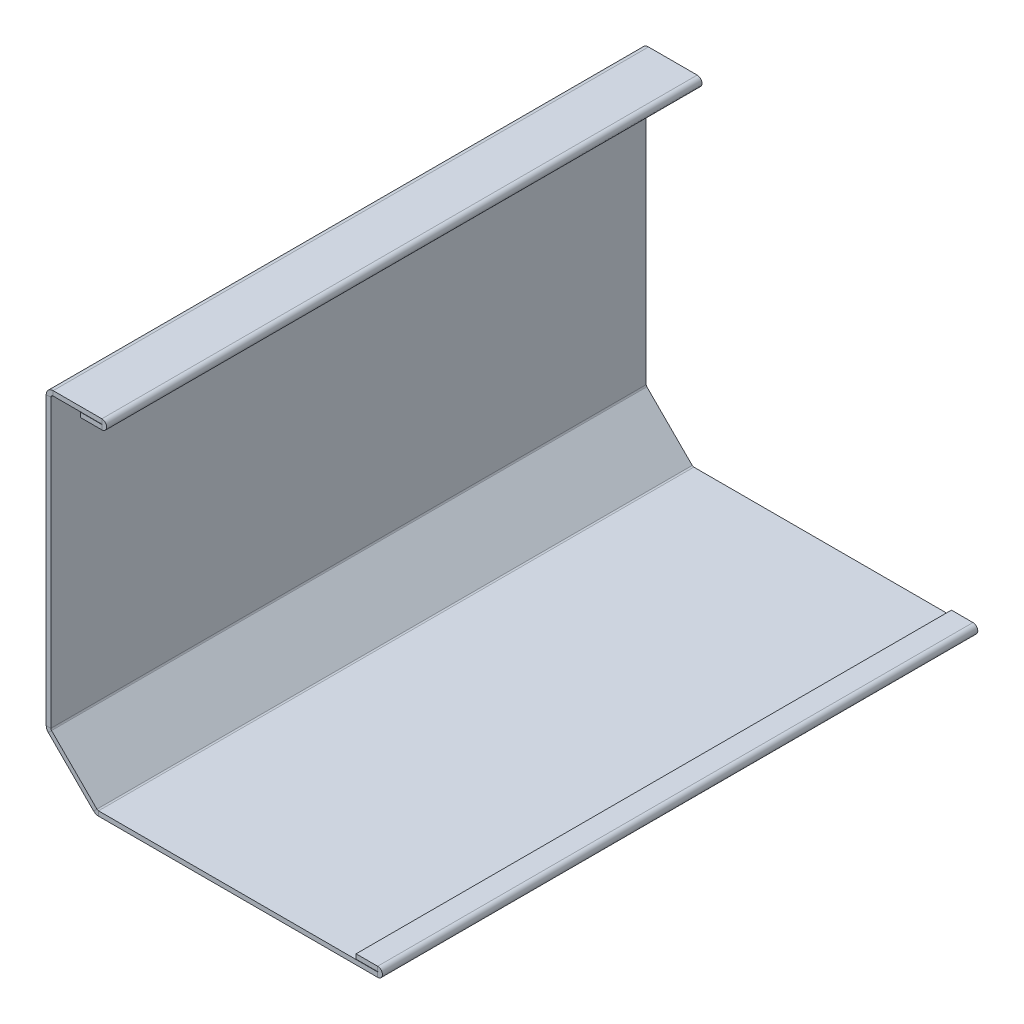
ISO-10303-21;
HEADER;
FILE_DESCRIPTION(('STEP AP214'),'2;1');
FILE_NAME('part.step','',(''),(''),'','','');
FILE_SCHEMA(('AUTOMOTIVE_DESIGN { 1 0 10303 214 1 1 1 1 }'));
ENDSEC;
DATA;
#1=APPLICATION_CONTEXT('core data for automotive mechanical design processes');
#2=APPLICATION_PROTOCOL_DEFINITION('international standard','automotive_design',2000,#1);
#3=PRODUCT_CONTEXT('',#1,'mechanical');
#4=PRODUCT('Part','Part','',(#3));
#5=PRODUCT_RELATED_PRODUCT_CATEGORY('part','',(#4));
#6=PRODUCT_DEFINITION_FORMATION('','',#4);
#7=PRODUCT_DEFINITION_CONTEXT('part definition',#1,'design');
#8=PRODUCT_DEFINITION('design','',#6,#7);
#9=PRODUCT_DEFINITION_SHAPE('','',#8);
#10=(LENGTH_UNIT() NAMED_UNIT(*) SI_UNIT(.MILLI.,.METRE.));
#11=(NAMED_UNIT(*) PLANE_ANGLE_UNIT() SI_UNIT($,.RADIAN.));
#12=(NAMED_UNIT(*) SI_UNIT($,.STERADIAN.) SOLID_ANGLE_UNIT());
#13=UNCERTAINTY_MEASURE_WITH_UNIT(LENGTH_MEASURE(1.E-05),#10,'distance_accuracy_value','');
#14=(GEOMETRIC_REPRESENTATION_CONTEXT(3) GLOBAL_UNCERTAINTY_ASSIGNED_CONTEXT((#13)) GLOBAL_UNIT_ASSIGNED_CONTEXT((#10,
#11,#12)) REPRESENTATION_CONTEXT('',''));
#15=CARTESIAN_POINT('',(0.,0.,0.));
#16=DIRECTION('',(0.,0.,1.));
#17=DIRECTION('',(1.,0.,0.));
#18=AXIS2_PLACEMENT_3D('',#15,#16,#17);
#19=CARTESIAN_POINT('',(-47.,-1.5,-96.));
#20=DIRECTION('',(0.,0.,-1.));
#21=DIRECTION('',(-1.,0.,0.));
#22=AXIS2_PLACEMENT_3D('',#19,#20,#21);
#23=PLANE('',#22);
#24=DIRECTION('',(-1.,0.,0.));
#25=VECTOR('',#24,1.);
#26=CARTESIAN_POINT('',(-47.,0.,-96.));
#27=LINE('',#26,#25);
#28=CARTESIAN_POINT('',(45.45,0.,-96.));
#29=VERTEX_POINT('',#28);
#30=CARTESIAN_POINT('',(-44.5735699463963,0.,-96.));
#31=VERTEX_POINT('',#30);
#32=EDGE_CURVE('E516',#29,#31,#27,.T.);
#33=ORIENTED_EDGE('',*,*,#32,.F.);
#34=DIRECTION('',(0.,-1.,0.));
#35=VECTOR('',#34,1.);
#36=CARTESIAN_POINT('',(45.45,0.,-96.));
#37=LINE('',#36,#35);
#38=CARTESIAN_POINT('',(45.45,-1.5,-96.));
#39=VERTEX_POINT('',#38);
#40=EDGE_CURVE('E115',#29,#39,#37,.T.);
#41=ORIENTED_EDGE('',*,*,#40,.T.);
#42=DIRECTION('',(-1.,0.,0.));
#43=VECTOR('',#42,1.);
#44=CARTESIAN_POINT('',(-47.,-1.5,-96.));
#45=LINE('',#44,#43);
#46=CARTESIAN_POINT('',(-44.5735699463963,-1.5,-96.));
#47=VERTEX_POINT('',#46);
#48=EDGE_CURVE('E107',#39,#47,#45,.T.);
#49=ORIENTED_EDGE('',*,*,#48,.T.);
#50=DIRECTION('',(0.,-1.,0.));
#51=VECTOR('',#50,1.);
#52=CARTESIAN_POINT('',(-44.5735699463963,0.,-96.));
#53=LINE('',#52,#51);
#54=EDGE_CURVE('E513',#31,#47,#53,.T.);
#55=ORIENTED_EDGE('',*,*,#54,.F.);
#56=EDGE_LOOP('',(#33,#41,#49,#55));
#57=FACE_BOUND('',#56,.T.);
#58=ADVANCED_FACE('F99',(#57),#23,.T.);
#59=CARTESIAN_POINT('',(-61.439339827979,110.039339827978,96.));
#60=DIRECTION('',(0.,0.,-1.));
#61=DIRECTION('',(0.,1.,0.));
#62=AXIS2_PLACEMENT_3D('',#59,#60,#61);
#63=PLANE('',#62);
#64=DIRECTION('',(-1.,0.,0.));
#65=VECTOR('',#64,1.);
#66=CARTESIAN_POINT('',(-59.939339827979,107.802739827978,96.));
#67=LINE('',#66,#65);
#68=CARTESIAN_POINT('',(-59.939339827979,107.802739827978,96.));
#69=VERTEX_POINT('',#68);
#70=CARTESIAN_POINT('',(-61.439339827979,107.802739827978,96.));
#71=VERTEX_POINT('',#70);
#72=EDGE_CURVE('E417',#69,#71,#67,.T.);
#73=ORIENTED_EDGE('',*,*,#72,.T.);
#74=DIRECTION('',(0.,1.,0.));
#75=VECTOR('',#74,1.);
#76=CARTESIAN_POINT('',(-61.4393398279778,-1.50000000000068,96.));
#77=LINE('',#76,#75);
#78=CARTESIAN_POINT('',(-61.439339827978,15.3657698815815,96.));
#79=VERTEX_POINT('',#78);
#80=EDGE_CURVE('E437',#79,#71,#77,.T.);
#81=ORIENTED_EDGE('',*,*,#80,.F.);
#82=DIRECTION('',(1.,0.,0.));
#83=VECTOR('',#82,1.);
#84=CARTESIAN_POINT('',(-59.939339827978,15.3657698815815,96.));
#85=LINE('',#84,#83);
#86=CARTESIAN_POINT('',(-59.939339827978,15.3657698815815,96.));
#87=VERTEX_POINT('',#86);
#88=EDGE_CURVE('E447',#87,#79,#85,.F.);
#89=ORIENTED_EDGE('',*,*,#88,.F.);
#90=DIRECTION('',(0.,-1.,0.));
#91=VECTOR('',#90,1.);
#92=CARTESIAN_POINT('',(-59.939339827979,110.039339827978,96.));
#93=LINE('',#92,#91);
#94=EDGE_CURVE('E441',#87,#69,#93,.F.);
#95=ORIENTED_EDGE('',*,*,#94,.T.);
#96=EDGE_LOOP('',(#73,#81,#89,#95));
#97=FACE_BOUND('',#96,.T.);
#98=ADVANCED_FACE('F553',(#97),#63,.F.);
#99=CARTESIAN_POINT('',(-61.439339827978,15.0606601715375,-96.));
#100=DIRECTION('',(0.,0.,1.));
#101=DIRECTION('',(0.,-1.,0.));
#102=AXIS2_PLACEMENT_3D('',#99,#100,#101);
#103=PLANE('',#102);
#104=DIRECTION('',(-1.,0.,0.));
#105=VECTOR('',#104,1.);
#106=CARTESIAN_POINT('',(-59.939339827979,107.802739827978,-95.9999999999999));
#107=LINE('',#106,#105);
#108=CARTESIAN_POINT('',(-59.939339827979,107.802739827978,-95.9999999999999));
#109=VERTEX_POINT('',#108);
#110=CARTESIAN_POINT('',(-61.439339827979,107.802739827978,-95.9999999999999));
#111=VERTEX_POINT('',#110);
#112=EDGE_CURVE('E428',#109,#111,#107,.T.);
#113=ORIENTED_EDGE('',*,*,#112,.F.);
#114=DIRECTION('',(0.,1.,0.));
#115=VECTOR('',#114,1.);
#116=CARTESIAN_POINT('',(-59.939339827978,15.0606601715375,-96.));
#117=LINE('',#116,#115);
#118=CARTESIAN_POINT('',(-59.939339827978,15.3657698815815,-95.9999999999999));
#119=VERTEX_POINT('',#118);
#120=EDGE_CURVE('E439',#109,#119,#117,.F.);
#121=ORIENTED_EDGE('',*,*,#120,.T.);
#122=DIRECTION('',(1.,0.,0.));
#123=VECTOR('',#122,1.);
#124=CARTESIAN_POINT('',(-61.439339827978,15.3657698815815,-96.));
#125=LINE('',#124,#123);
#126=CARTESIAN_POINT('',(-61.439339827978,15.3657698815815,-95.9999999999999));
#127=VERTEX_POINT('',#126);
#128=EDGE_CURVE('E431',#119,#127,#125,.F.);
#129=ORIENTED_EDGE('',*,*,#128,.T.);
#130=DIRECTION('',(0.,-1.,0.));
#131=VECTOR('',#130,1.);
#132=CARTESIAN_POINT('',(-61.4393398279778,-1.50000000000065,-96.));
#133=LINE('',#132,#131);
#134=EDGE_CURVE('E434',#111,#127,#133,.T.);
#135=ORIENTED_EDGE('',*,*,#134,.F.);
#136=EDGE_LOOP('',(#113,#121,#129,#135));
#137=FACE_BOUND('',#136,.T.);
#138=ADVANCED_FACE('F557',(#137),#103,.F.);
#139=CARTESIAN_POINT('',(-61.4393398279778,-1.50000000000067,0.));
#140=DIRECTION('',(1.,0.,0.));
#141=DIRECTION('',(0.,1.,0.));
#142=AXIS2_PLACEMENT_3D('',#139,#140,#141);
#143=PLANE('',#142);
#144=DIRECTION('',(0.,0.,1.));
#145=VECTOR('',#144,1.);
#146=CARTESIAN_POINT('',(-61.439339827979,107.802739827978,96.));
#147=LINE('',#146,#145);
#148=EDGE_CURVE('E411',#71,#111,#147,.F.);
#149=ORIENTED_EDGE('',*,*,#148,.T.);
#150=ORIENTED_EDGE('',*,*,#134,.T.);
#151=DIRECTION('',(0.,0.,1.));
#152=VECTOR('',#151,1.);
#153=CARTESIAN_POINT('',(-61.439339827978,15.3657698815815,-96.));
#154=LINE('',#153,#152);
#155=EDGE_CURVE('E444',#79,#127,#154,.F.);
#156=ORIENTED_EDGE('',*,*,#155,.F.);
#157=ORIENTED_EDGE('',*,*,#80,.T.);
#158=EDGE_LOOP('',(#149,#150,#156,#157));
#159=FACE_BOUND('',#158,.T.);
#160=ADVANCED_FACE('F673',(#159),#143,.F.);
#161=CARTESIAN_POINT('',(-59.9393398279778,-1.50000000000065,0.));
#162=DIRECTION('',(1.,0.,0.));
#163=DIRECTION('',(0.,1.,0.));
#164=AXIS2_PLACEMENT_3D('',#161,#162,#163);
#165=PLANE('',#164);
#166=ORIENTED_EDGE('',*,*,#120,.F.);
#167=DIRECTION('',(0.,0.,1.));
#168=VECTOR('',#167,1.);
#169=CARTESIAN_POINT('',(-59.939339827979,107.802739827978,96.));
#170=LINE('',#169,#168);
#171=EDGE_CURVE('E423',#69,#109,#170,.F.);
#172=ORIENTED_EDGE('',*,*,#171,.F.);
#173=ORIENTED_EDGE('',*,*,#94,.F.);
#174=DIRECTION('',(0.,0.,1.));
#175=VECTOR('',#174,1.);
#176=CARTESIAN_POINT('',(-59.939339827978,15.3657698815815,-96.));
#177=LINE('',#176,#175);
#178=EDGE_CURVE('E450',#119,#87,#177,.T.);
#179=ORIENTED_EDGE('',*,*,#178,.F.);
#180=EDGE_LOOP('',(#166,#172,#173,#179));
#181=FACE_BOUND('',#180,.T.);
#182=ADVANCED_FACE('F589',(#181),#165,.T.);
#183=CARTESIAN_POINT('',(-62.4999999997578,15.4999999997576,96.));
#184=DIRECTION('',(0.,0.,-1.));
#185=DIRECTION('',(0.,1.,0.));
#186=AXIS2_PLACEMENT_3D('',#183,#184,#185);
#187=PLANE('',#186);
#188=DIRECTION('',(-0.707106781186531,-0.707106781186564,0.));
#189=VECTOR('',#188,1.);
#190=CARTESIAN_POINT('',(-59.723594683,14.8449150265595,96.));
#191=LINE('',#190,#189);
#192=CARTESIAN_POINT('',(-59.723594683,14.8449150265595,96.));
#193=VERTEX_POINT('',#192);
#194=CARTESIAN_POINT('',(-60.7842548547798,13.7842548547796,96.));
#195=VERTEX_POINT('',#194);
#196=EDGE_CURVE('E460',#193,#195,#191,.T.);
#197=ORIENTED_EDGE('',*,*,#196,.T.);
#198=DIRECTION('',(-0.707106781186551,0.707106781186544,0.));
#199=VECTOR('',#198,1.);
#200=CARTESIAN_POINT('',(-22.4393398282199,-24.5606601717798,96.));
#201=LINE('',#200,#199);
#202=CARTESIAN_POINT('',(-46.1550849731981,-0.844915026801855,96.));
#203=VERTEX_POINT('',#202);
#204=EDGE_CURVE('E480',#203,#195,#201,.T.);
#205=ORIENTED_EDGE('',*,*,#204,.F.);
#206=DIRECTION('',(0.707106781186544,0.707106781186551,0.));
#207=VECTOR('',#206,1.);
#208=CARTESIAN_POINT('',(-45.0944248014183,0.215745144977974,96.));
#209=LINE('',#208,#207);
#210=CARTESIAN_POINT('',(-45.0944248014183,0.215745144977975,96.));
#211=VERTEX_POINT('',#210);
#212=EDGE_CURVE('E490',#211,#203,#209,.F.);
#213=ORIENTED_EDGE('',*,*,#212,.F.);
#214=DIRECTION('',(0.707106781186551,-0.707106781186544,0.));
#215=VECTOR('',#214,1.);
#216=CARTESIAN_POINT('',(-61.439339827978,16.5606601715375,96.));
#217=LINE('',#216,#215);
#218=EDGE_CURVE('E484',#211,#193,#217,.F.);
#219=ORIENTED_EDGE('',*,*,#218,.T.);
#220=EDGE_LOOP('',(#197,#205,#213,#219));
#221=FACE_BOUND('',#220,.T.);
#222=ADVANCED_FACE('F679',(#221),#187,.F.);
#223=CARTESIAN_POINT('',(-45.9393398282202,-1.06066017177983,-96.));
#224=DIRECTION('',(0.,0.,1.));
#225=DIRECTION('',(0.,-1.,0.));
#226=AXIS2_PLACEMENT_3D('',#223,#224,#225);
#227=PLANE('',#226);
#228=DIRECTION('',(-0.707106781186531,-0.707106781186564,0.));
#229=VECTOR('',#228,1.);
#230=CARTESIAN_POINT('',(-59.723594683,14.8449150265595,-95.9999999999999));
#231=LINE('',#230,#229);
#232=CARTESIAN_POINT('',(-59.723594683,14.8449150265595,-95.9999999999999));
#233=VERTEX_POINT('',#232);
#234=CARTESIAN_POINT('',(-60.7842548547798,13.7842548547796,-95.9999999999999));
#235=VERTEX_POINT('',#234);
#236=EDGE_CURVE('E471',#233,#235,#231,.T.);
#237=ORIENTED_EDGE('',*,*,#236,.F.);
#238=DIRECTION('',(-0.707106781186551,0.707106781186544,0.));
#239=VECTOR('',#238,1.);
#240=CARTESIAN_POINT('',(-44.8786796564404,0.,-96.));
#241=LINE('',#240,#239);
#242=CARTESIAN_POINT('',(-45.0944248014183,0.215745144977975,-96.));
#243=VERTEX_POINT('',#242);
#244=EDGE_CURVE('E482',#233,#243,#241,.F.);
#245=ORIENTED_EDGE('',*,*,#244,.T.);
#246=DIRECTION('',(0.707106781186544,0.707106781186551,0.));
#247=VECTOR('',#246,1.);
#248=CARTESIAN_POINT('',(-46.1550849731982,-0.844915026801838,-96.));
#249=LINE('',#248,#247);
#250=CARTESIAN_POINT('',(-46.1550849731982,-0.844915026801847,-96.));
#251=VERTEX_POINT('',#250);
#252=EDGE_CURVE('E474',#243,#251,#249,.F.);
#253=ORIENTED_EDGE('',*,*,#252,.T.);
#254=DIRECTION('',(0.707106781186551,-0.707106781186544,0.));
#255=VECTOR('',#254,1.);
#256=CARTESIAN_POINT('',(-22.4393398282199,-24.5606601717798,-96.));
#257=LINE('',#256,#255);
#258=EDGE_CURVE('E477',#235,#251,#257,.T.);
#259=ORIENTED_EDGE('',*,*,#258,.F.);
#260=EDGE_LOOP('',(#237,#245,#253,#259));
#261=FACE_BOUND('',#260,.T.);
#262=ADVANCED_FACE('F571',(#261),#227,.F.);
#263=CARTESIAN_POINT('',(-22.4393398282199,-24.5606601717798,0.));
#264=DIRECTION('',(0.707106781186544,0.707106781186551,0.));
#265=DIRECTION('',(-0.707106781186551,0.707106781186544,0.));
#266=AXIS2_PLACEMENT_3D('',#263,#264,#265);
#267=PLANE('',#266);
#268=DIRECTION('',(0.,0.,1.));
#269=VECTOR('',#268,1.);
#270=CARTESIAN_POINT('',(-60.7842548547798,13.7842548547796,96.));
#271=LINE('',#270,#269);
#272=EDGE_CURVE('E454',#195,#235,#271,.F.);
#273=ORIENTED_EDGE('',*,*,#272,.T.);
#274=ORIENTED_EDGE('',*,*,#258,.T.);
#275=DIRECTION('',(0.,0.,1.));
#276=VECTOR('',#275,1.);
#277=CARTESIAN_POINT('',(-46.1550849731982,-0.844915026801844,-96.));
#278=LINE('',#277,#276);
#279=EDGE_CURVE('E487',#203,#251,#278,.F.);
#280=ORIENTED_EDGE('',*,*,#279,.F.);
#281=ORIENTED_EDGE('',*,*,#204,.T.);
#282=EDGE_LOOP('',(#273,#274,#280,#281));
#283=FACE_BOUND('',#282,.T.);
#284=ADVANCED_FACE('F694',(#283),#267,.F.);
#285=CARTESIAN_POINT('',(-21.3786796564401,-23.5,0.));
#286=DIRECTION('',(0.707106781186544,0.707106781186551,0.));
#287=DIRECTION('',(-0.707106781186551,0.707106781186544,0.));
#288=AXIS2_PLACEMENT_3D('',#285,#286,#287);
#289=PLANE('',#288);
#290=ORIENTED_EDGE('',*,*,#244,.F.);
#291=DIRECTION('',(0.,0.,1.));
#292=VECTOR('',#291,1.);
#293=CARTESIAN_POINT('',(-59.723594683,14.8449150265595,96.));
#294=LINE('',#293,#292);
#295=EDGE_CURVE('E466',#193,#233,#294,.F.);
#296=ORIENTED_EDGE('',*,*,#295,.F.);
#297=ORIENTED_EDGE('',*,*,#218,.F.);
#298=DIRECTION('',(0.,0.,1.));
#299=VECTOR('',#298,1.);
#300=CARTESIAN_POINT('',(-45.0944248014183,0.215745144977984,-96.));
#301=LINE('',#300,#299);
#302=EDGE_CURVE('E493',#243,#211,#301,.T.);
#303=ORIENTED_EDGE('',*,*,#302,.F.);
#304=EDGE_LOOP('',(#290,#296,#297,#303));
#305=FACE_BOUND('',#304,.T.);
#306=ADVANCED_FACE('F574',(#305),#289,.T.);
#307=CARTESIAN_POINT('',(-47.,-1.5,96.));
#308=DIRECTION('',(0.,0.,1.));
#309=DIRECTION('',(1.,0.,0.));
#310=AXIS2_PLACEMENT_3D('',#307,#308,#309);
#311=PLANE('',#310);
#312=DIRECTION('',(0.,-1.,0.));
#313=VECTOR('',#312,1.);
#314=CARTESIAN_POINT('',(45.45,0.,96.));
#315=LINE('',#314,#313);
#316=CARTESIAN_POINT('',(45.45,0.,96.));
#317=VERTEX_POINT('',#316);
#318=CARTESIAN_POINT('',(45.45,-1.5,96.));
#319=VERTEX_POINT('',#318);
#320=EDGE_CURVE('E266',#317,#319,#315,.T.);
#321=ORIENTED_EDGE('',*,*,#320,.F.);
#322=DIRECTION('',(1.,0.,0.));
#323=VECTOR('',#322,1.);
#324=CARTESIAN_POINT('',(-47.,0.,96.));
#325=LINE('',#324,#323);
#326=CARTESIAN_POINT('',(-44.5735699463963,0.,96.));
#327=VERTEX_POINT('',#326);
#328=EDGE_CURVE('E102',#327,#317,#325,.T.);
#329=ORIENTED_EDGE('',*,*,#328,.F.);
#330=DIRECTION('',(0.,-1.,0.));
#331=VECTOR('',#330,1.);
#332=CARTESIAN_POINT('',(-44.5735699463963,0.,96.));
#333=LINE('',#332,#331);
#334=CARTESIAN_POINT('',(-44.5735699463963,-1.50000000000001,96.));
#335=VERTEX_POINT('',#334);
#336=EDGE_CURVE('E269',#327,#335,#333,.T.);
#337=ORIENTED_EDGE('',*,*,#336,.T.);
#338=DIRECTION('',(1.,0.,0.));
#339=VECTOR('',#338,1.);
#340=CARTESIAN_POINT('',(-47.,-1.5,96.));
#341=LINE('',#340,#339);
#342=EDGE_CURVE('E13',#335,#319,#341,.T.);
#343=ORIENTED_EDGE('',*,*,#342,.T.);
#344=EDGE_LOOP('',(#321,#329,#337,#343));
#345=FACE_BOUND('',#344,.T.);
#346=ADVANCED_FACE('F263',(#345),#311,.T.);
#347=CARTESIAN_POINT('',(0.,-1.5,0.));
#348=DIRECTION('',(0.,1.,0.));
#349=DIRECTION('',(0.,0.,1.));
#350=AXIS2_PLACEMENT_3D('',#347,#348,#349);
#351=PLANE('',#350);
#352=ORIENTED_EDGE('',*,*,#48,.F.);
#353=DIRECTION('',(0.,0.,-1.));
#354=VECTOR('',#353,1.);
#355=CARTESIAN_POINT('',(45.45,-1.5,-96.));
#356=LINE('',#355,#354);
#357=EDGE_CURVE('E274',#39,#319,#356,.F.);
#358=ORIENTED_EDGE('',*,*,#357,.T.);
#359=ORIENTED_EDGE('',*,*,#342,.F.);
#360=DIRECTION('',(0.,0.,1.));
#361=VECTOR('',#360,1.);
#362=CARTESIAN_POINT('',(-44.5735699463963,-1.50000000000001,96.));
#363=LINE('',#362,#361);
#364=EDGE_CURVE('E497',#335,#47,#363,.F.);
#365=ORIENTED_EDGE('',*,*,#364,.T.);
#366=EDGE_LOOP('',(#352,#358,#359,#365));
#367=FACE_BOUND('',#366,.T.);
#368=ADVANCED_FACE('F275',(#367),#351,.F.);
#369=CARTESIAN_POINT('',(0.,0.,0.));
#370=DIRECTION('',(0.,1.,0.));
#371=DIRECTION('',(0.,0.,1.));
#372=AXIS2_PLACEMENT_3D('',#369,#370,#371);
#373=PLANE('',#372);
#374=DIRECTION('',(0.,0.,-1.));
#375=VECTOR('',#374,1.);
#376=CARTESIAN_POINT('',(45.45,0.,-96.));
#377=LINE('',#376,#375);
#378=EDGE_CURVE('E300',#29,#317,#377,.F.);
#379=ORIENTED_EDGE('',*,*,#378,.F.);
#380=ORIENTED_EDGE('',*,*,#32,.T.);
#381=DIRECTION('',(0.,0.,1.));
#382=VECTOR('',#381,1.);
#383=CARTESIAN_POINT('',(-44.5735699463963,0.,96.));
#384=LINE('',#383,#382);
#385=EDGE_CURVE('E508',#327,#31,#384,.F.);
#386=ORIENTED_EDGE('',*,*,#385,.F.);
#387=ORIENTED_EDGE('',*,*,#328,.T.);
#388=EDGE_LOOP('',(#379,#380,#386,#387));
#389=FACE_BOUND('',#388,.T.);
#390=ADVANCED_FACE('F520',(#389),#373,.T.);
#391=CARTESIAN_POINT('',(-44.5735699463963,0.73659999999999,-96.));
#392=DIRECTION('',(0.,0.,-1.));
#393=DIRECTION('',(-1.,0.,0.));
#394=AXIS2_PLACEMENT_3D('',#391,#392,#393);
#395=PLANE('',#394);
#396=ORIENTED_EDGE('',*,*,#252,.F.);
#397=CARTESIAN_POINT('',(-44.5735699463963,0.73659999999999,-96.));
#398=DIRECTION('',(0.,0.,1.));
#399=DIRECTION('',(1.,0.,0.));
#400=AXIS2_PLACEMENT_3D('',#397,#398,#399);
#401=CIRCLE('',#400,0.736600000000003);
#402=EDGE_CURVE('E505',#31,#243,#401,.F.);
#403=ORIENTED_EDGE('',*,*,#402,.F.);
#404=ORIENTED_EDGE('',*,*,#54,.T.);
#405=CARTESIAN_POINT('',(-44.5735699463963,0.73659999999999,-96.));
#406=DIRECTION('',(0.,0.,1.));
#407=DIRECTION('',(1.,0.,0.));
#408=AXIS2_PLACEMENT_3D('',#405,#406,#407);
#409=CIRCLE('',#408,2.2366);
#410=EDGE_CURVE('E499',#47,#251,#409,.F.);
#411=ORIENTED_EDGE('',*,*,#410,.T.);
#412=EDGE_LOOP('',(#396,#403,#404,#411));
#413=FACE_BOUND('',#412,.T.);
#414=ADVANCED_FACE('F568',(#413),#395,.T.);
#415=CARTESIAN_POINT('',(-44.5735699463963,0.73659999999999,96.));
#416=DIRECTION('',(0.,0.,-1.));
#417=DIRECTION('',(-1.,0.,0.));
#418=AXIS2_PLACEMENT_3D('',#415,#416,#417);
#419=PLANE('',#418);
#420=CARTESIAN_POINT('',(-44.5735699463963,0.73659999999999,96.));
#421=DIRECTION('',(0.,0.,1.));
#422=DIRECTION('',(1.,0.,0.));
#423=AXIS2_PLACEMENT_3D('',#420,#421,#422);
#424=CIRCLE('',#423,0.736600000000003);
#425=EDGE_CURVE('E479',#211,#327,#424,.T.);
#426=ORIENTED_EDGE('',*,*,#425,.F.);
#427=ORIENTED_EDGE('',*,*,#212,.T.);
#428=CARTESIAN_POINT('',(-44.5735699463963,0.73659999999999,96.));
#429=DIRECTION('',(0.,0.,1.));
#430=DIRECTION('',(1.,0.,0.));
#431=AXIS2_PLACEMENT_3D('',#428,#429,#430);
#432=CIRCLE('',#431,2.2366);
#433=EDGE_CURVE('E500',#203,#335,#432,.T.);
#434=ORIENTED_EDGE('',*,*,#433,.T.);
#435=ORIENTED_EDGE('',*,*,#336,.F.);
#436=EDGE_LOOP('',(#426,#427,#434,#435));
#437=FACE_BOUND('',#436,.T.);
#438=ADVANCED_FACE('F708',(#437),#419,.F.);
#439=CARTESIAN_POINT('',(-44.5735699463963,0.73659999999999,96.));
#440=DIRECTION('',(0.,0.,1.));
#441=DIRECTION('',(-0.707106781186544,-0.707106781186551,0.));
#442=AXIS2_PLACEMENT_3D('',#439,#440,#441);
#443=CYLINDRICAL_SURFACE('',#442,2.2366);
#444=ORIENTED_EDGE('',*,*,#364,.F.);
#445=ORIENTED_EDGE('',*,*,#433,.F.);
#446=ORIENTED_EDGE('',*,*,#279,.T.);
#447=ORIENTED_EDGE('',*,*,#410,.F.);
#448=EDGE_LOOP('',(#444,#445,#446,#447));
#449=FACE_BOUND('',#448,.T.);
#450=ADVANCED_FACE('F705',(#449),#443,.T.);
#451=CARTESIAN_POINT('',(-44.5735699463963,0.73659999999999,96.));
#452=DIRECTION('',(0.,0.,1.));
#453=DIRECTION('',(-0.707106781186544,-0.707106781186551,0.));
#454=AXIS2_PLACEMENT_3D('',#451,#452,#453);
#455=CYLINDRICAL_SURFACE('',#454,0.736600000000003);
#456=ORIENTED_EDGE('',*,*,#385,.T.);
#457=ORIENTED_EDGE('',*,*,#402,.T.);
#458=ORIENTED_EDGE('',*,*,#302,.T.);
#459=ORIENTED_EDGE('',*,*,#425,.T.);
#460=EDGE_LOOP('',(#456,#457,#458,#459));
#461=FACE_BOUND('',#460,.T.);
#462=ADVANCED_FACE('F564',(#461),#455,.F.);
#463=CARTESIAN_POINT('',(-59.202739827978,15.3657698815815,-95.9999999999999));
#464=DIRECTION('',(0.,0.,-1.));
#465=DIRECTION('',(-1.,0.,0.));
#466=AXIS2_PLACEMENT_3D('',#463,#464,#465);
#467=PLANE('',#466);
#468=ORIENTED_EDGE('',*,*,#128,.F.);
#469=CARTESIAN_POINT('',(-59.202739827978,15.3657698815815,-95.9999999999999));
#470=DIRECTION('',(0.,0.,1.));
#471=DIRECTION('',(1.,0.,0.));
#472=AXIS2_PLACEMENT_3D('',#469,#470,#471);
#473=CIRCLE('',#472,0.736600000000011);
#474=EDGE_CURVE('E463',#233,#119,#473,.F.);
#475=ORIENTED_EDGE('',*,*,#474,.F.);
#476=ORIENTED_EDGE('',*,*,#236,.T.);
#477=CARTESIAN_POINT('',(-59.202739827978,15.3657698815815,-95.9999999999999));
#478=DIRECTION('',(0.,0.,1.));
#479=DIRECTION('',(1.,0.,0.));
#480=AXIS2_PLACEMENT_3D('',#477,#478,#479);
#481=CIRCLE('',#480,2.23660000000001);
#482=EDGE_CURVE('E456',#235,#127,#481,.F.);
#483=ORIENTED_EDGE('',*,*,#482,.T.);
#484=EDGE_LOOP('',(#468,#475,#476,#483));
#485=FACE_BOUND('',#484,.T.);
#486=ADVANCED_FACE('F583',(#485),#467,.T.);
#487=CARTESIAN_POINT('',(-59.202739827978,15.3657698815815,96.));
#488=DIRECTION('',(0.,0.,-1.));
#489=DIRECTION('',(-1.,0.,0.));
#490=AXIS2_PLACEMENT_3D('',#487,#488,#489);
#491=PLANE('',#490);
#492=CARTESIAN_POINT('',(-59.202739827978,15.3657698815815,96.));
#493=DIRECTION('',(0.,0.,1.));
#494=DIRECTION('',(1.,0.,0.));
#495=AXIS2_PLACEMENT_3D('',#492,#493,#494);
#496=CIRCLE('',#495,0.736600000000011);
#497=EDGE_CURVE('E436',#87,#193,#496,.T.);
#498=ORIENTED_EDGE('',*,*,#497,.F.);
#499=ORIENTED_EDGE('',*,*,#88,.T.);
#500=CARTESIAN_POINT('',(-59.202739827978,15.3657698815815,96.));
#501=DIRECTION('',(0.,0.,1.));
#502=DIRECTION('',(1.,0.,0.));
#503=AXIS2_PLACEMENT_3D('',#500,#501,#502);
#504=CIRCLE('',#503,2.23660000000001);
#505=EDGE_CURVE('E457',#79,#195,#504,.T.);
#506=ORIENTED_EDGE('',*,*,#505,.T.);
#507=ORIENTED_EDGE('',*,*,#196,.F.);
#508=EDGE_LOOP('',(#498,#499,#506,#507));
#509=FACE_BOUND('',#508,.T.);
#510=ADVANCED_FACE('F685',(#509),#491,.F.);
#511=CARTESIAN_POINT('',(-59.202739827978,15.3657698815815,96.));
#512=DIRECTION('',(0.,0.,1.));
#513=DIRECTION('',(-1.,0.,0.));
#514=AXIS2_PLACEMENT_3D('',#511,#512,#513);
#515=CYLINDRICAL_SURFACE('',#514,2.23660000000001);
#516=ORIENTED_EDGE('',*,*,#272,.F.);
#517=ORIENTED_EDGE('',*,*,#505,.F.);
#518=ORIENTED_EDGE('',*,*,#155,.T.);
#519=ORIENTED_EDGE('',*,*,#482,.F.);
#520=EDGE_LOOP('',(#516,#517,#518,#519));
#521=FACE_BOUND('',#520,.T.);
#522=ADVANCED_FACE('F682',(#521),#515,.T.);
#523=CARTESIAN_POINT('',(-59.202739827978,15.3657698815815,96.));
#524=DIRECTION('',(0.,0.,1.));
#525=DIRECTION('',(-1.,0.,0.));
#526=AXIS2_PLACEMENT_3D('',#523,#524,#525);
#527=CYLINDRICAL_SURFACE('',#526,0.736600000000011);
#528=ORIENTED_EDGE('',*,*,#295,.T.);
#529=ORIENTED_EDGE('',*,*,#474,.T.);
#530=ORIENTED_EDGE('',*,*,#178,.T.);
#531=ORIENTED_EDGE('',*,*,#497,.T.);
#532=EDGE_LOOP('',(#528,#529,#530,#531));
#533=FACE_BOUND('',#532,.T.);
#534=ADVANCED_FACE('F578',(#533),#527,.F.);
#535=CARTESIAN_POINT('',(-59.202739827979,107.802739827978,-95.9999999999999));
#536=DIRECTION('',(0.,0.,-1.));
#537=DIRECTION('',(-1.,0.,0.));
#538=AXIS2_PLACEMENT_3D('',#535,#536,#537);
#539=PLANE('',#538);
#540=DIRECTION('',(0.,-1.,0.));
#541=VECTOR('',#540,1.);
#542=CARTESIAN_POINT('',(-59.202739827979,110.039339827978,-96.));
#543=LINE('',#542,#541);
#544=CARTESIAN_POINT('',(-59.202739827979,108.539339827978,-95.9999999999999));
#545=VERTEX_POINT('',#544);
#546=CARTESIAN_POINT('',(-59.202739827979,110.039339827978,-95.9999999999999));
#547=VERTEX_POINT('',#546);
#548=EDGE_CURVE('E390',#545,#547,#543,.F.);
#549=ORIENTED_EDGE('',*,*,#548,.F.);
#550=CARTESIAN_POINT('',(-59.202739827979,107.802739827978,-95.9999999999999));
#551=DIRECTION('',(0.,0.,1.));
#552=DIRECTION('',(1.,0.,0.));
#553=AXIS2_PLACEMENT_3D('',#550,#551,#552);
#554=CIRCLE('',#553,0.73659999999999);
#555=EDGE_CURVE('E420',#109,#545,#554,.F.);
#556=ORIENTED_EDGE('',*,*,#555,.F.);
#557=ORIENTED_EDGE('',*,*,#112,.T.);
#558=CARTESIAN_POINT('',(-59.202739827979,107.802739827978,-95.9999999999999));
#559=DIRECTION('',(0.,0.,1.));
#560=DIRECTION('',(1.,0.,0.));
#561=AXIS2_PLACEMENT_3D('',#558,#559,#560);
#562=CIRCLE('',#561,2.23659999999999);
#563=EDGE_CURVE('E413',#111,#547,#562,.F.);
#564=ORIENTED_EDGE('',*,*,#563,.T.);
#565=EDGE_LOOP('',(#549,#556,#557,#564));
#566=FACE_BOUND('',#565,.T.);
#567=ADVANCED_FACE('F598',(#566),#539,.T.);
#568=CARTESIAN_POINT('',(-59.202739827979,107.802739827978,96.));
#569=DIRECTION('',(0.,0.,-1.));
#570=DIRECTION('',(-1.,0.,0.));
#571=AXIS2_PLACEMENT_3D('',#568,#569,#570);
#572=PLANE('',#571);
#573=CARTESIAN_POINT('',(-59.202739827979,107.802739827978,96.));
#574=DIRECTION('',(0.,0.,1.));
#575=DIRECTION('',(1.,0.,0.));
#576=AXIS2_PLACEMENT_3D('',#573,#574,#575);
#577=CIRCLE('',#576,0.73659999999999);
#578=CARTESIAN_POINT('',(-59.202739827979,108.539339827978,96.));
#579=VERTEX_POINT('',#578);
#580=EDGE_CURVE('E394',#579,#69,#577,.T.);
#581=ORIENTED_EDGE('',*,*,#580,.F.);
#582=DIRECTION('',(0.,-1.,0.));
#583=VECTOR('',#582,1.);
#584=CARTESIAN_POINT('',(-59.202739827979,108.539339827978,96.));
#585=LINE('',#584,#583);
#586=CARTESIAN_POINT('',(-59.202739827979,110.039339827978,96.));
#587=VERTEX_POINT('',#586);
#588=EDGE_CURVE('E404',#579,#587,#585,.F.);
#589=ORIENTED_EDGE('',*,*,#588,.T.);
#590=CARTESIAN_POINT('',(-59.202739827979,107.802739827978,96.));
#591=DIRECTION('',(0.,0.,1.));
#592=DIRECTION('',(1.,0.,0.));
#593=AXIS2_PLACEMENT_3D('',#590,#591,#592);
#594=CIRCLE('',#593,2.23659999999999);
#595=EDGE_CURVE('E414',#587,#71,#594,.T.);
#596=ORIENTED_EDGE('',*,*,#595,.T.);
#597=ORIENTED_EDGE('',*,*,#72,.F.);
#598=EDGE_LOOP('',(#581,#589,#596,#597));
#599=FACE_BOUND('',#598,.T.);
#600=ADVANCED_FACE('F609',(#599),#572,.F.);
#601=CARTESIAN_POINT('',(-59.202739827979,107.802739827978,96.));
#602=DIRECTION('',(0.,0.,1.));
#603=DIRECTION('',(0.,1.,0.));
#604=AXIS2_PLACEMENT_3D('',#601,#602,#603);
#605=CYLINDRICAL_SURFACE('',#604,2.23659999999999);
#606=ORIENTED_EDGE('',*,*,#148,.F.);
#607=ORIENTED_EDGE('',*,*,#595,.F.);
#608=DIRECTION('',(0.,0.,1.));
#609=VECTOR('',#608,1.);
#610=CARTESIAN_POINT('',(-59.202739827979,110.039339827978,-96.));
#611=LINE('',#610,#609);
#612=EDGE_CURVE('E401',#587,#547,#611,.F.);
#613=ORIENTED_EDGE('',*,*,#612,.T.);
#614=ORIENTED_EDGE('',*,*,#563,.F.);
#615=EDGE_LOOP('',(#606,#607,#613,#614));
#616=FACE_BOUND('',#615,.T.);
#617=ADVANCED_FACE('F663',(#616),#605,.T.);
#618=CARTESIAN_POINT('',(-59.202739827979,107.802739827978,96.));
#619=DIRECTION('',(0.,0.,1.));
#620=DIRECTION('',(0.,1.,0.));
#621=AXIS2_PLACEMENT_3D('',#618,#619,#620);
#622=CYLINDRICAL_SURFACE('',#621,0.73659999999999);
#623=ORIENTED_EDGE('',*,*,#171,.T.);
#624=ORIENTED_EDGE('',*,*,#555,.T.);
#625=DIRECTION('',(0.,0.,1.));
#626=VECTOR('',#625,1.);
#627=CARTESIAN_POINT('',(-59.202739827979,108.539339827978,-96.));
#628=LINE('',#627,#626);
#629=EDGE_CURVE('E407',#545,#579,#628,.T.);
#630=ORIENTED_EDGE('',*,*,#629,.T.);
#631=ORIENTED_EDGE('',*,*,#580,.T.);
#632=EDGE_LOOP('',(#623,#624,#630,#631));
#633=FACE_BOUND('',#632,.T.);
#634=ADVANCED_FACE('F593',(#633),#622,.F.);
#635=CARTESIAN_POINT('',(-41.939339827979,110.039339827978,96.));
#636=DIRECTION('',(0.,0.,-1.));
#637=DIRECTION('',(0.,1.,0.));
#638=AXIS2_PLACEMENT_3D('',#635,#636,#637);
#639=PLANE('',#638);
#640=DIRECTION('',(-1.,0.,0.));
#641=VECTOR('',#640,1.);
#642=CARTESIAN_POINT('',(-41.939339827979,108.539339827978,96.));
#643=LINE('',#642,#641);
#644=CARTESIAN_POINT('',(-43.489339827979,108.539339827978,96.));
#645=VERTEX_POINT('',#644);
#646=EDGE_CURVE('E399',#579,#645,#643,.F.);
#647=ORIENTED_EDGE('',*,*,#646,.T.);
#648=DIRECTION('',(1.3877787807816E-13,1.,0.));
#649=VECTOR('',#648,1.);
#650=CARTESIAN_POINT('',(-43.489339827979,108.539339827978,96.));
#651=LINE('',#650,#649);
#652=CARTESIAN_POINT('',(-43.489339827979,110.039339827978,96.));
#653=VERTEX_POINT('',#652);
#654=EDGE_CURVE('E123',#645,#653,#651,.T.);
#655=ORIENTED_EDGE('',*,*,#654,.T.);
#656=DIRECTION('',(1.,0.,0.));
#657=VECTOR('',#656,1.);
#658=CARTESIAN_POINT('',(-1.53233983065294E-12,110.039339827979,96.));
#659=LINE('',#658,#657);
#660=EDGE_CURVE('E395',#587,#653,#659,.T.);
#661=ORIENTED_EDGE('',*,*,#660,.F.);
#662=ORIENTED_EDGE('',*,*,#588,.F.);
#663=EDGE_LOOP('',(#647,#655,#661,#662));
#664=FACE_BOUND('',#663,.T.);
#665=ADVANCED_FACE('F611',(#664),#639,.F.);
#666=CARTESIAN_POINT('',(-59.939339827979,110.039339827978,-96.));
#667=DIRECTION('',(0.,0.,1.));
#668=DIRECTION('',(0.,-1.,0.));
#669=AXIS2_PLACEMENT_3D('',#666,#667,#668);
#670=PLANE('',#669);
#671=DIRECTION('',(-1.,0.,0.));
#672=VECTOR('',#671,1.);
#673=CARTESIAN_POINT('',(-1.53233983065294E-12,110.039339827979,-96.));
#674=LINE('',#673,#672);
#675=CARTESIAN_POINT('',(-43.4893398279788,110.039339827978,-96.));
#676=VERTEX_POINT('',#675);
#677=EDGE_CURVE('E392',#676,#547,#674,.T.);
#678=ORIENTED_EDGE('',*,*,#677,.F.);
#679=DIRECTION('',(1.3877787807816E-13,1.,0.));
#680=VECTOR('',#679,1.);
#681=CARTESIAN_POINT('',(-43.489339827979,108.539339827978,-96.));
#682=LINE('',#681,#680);
#683=CARTESIAN_POINT('',(-43.489339827979,108.539339827978,-96.));
#684=VERTEX_POINT('',#683);
#685=EDGE_CURVE('E354',#684,#676,#682,.T.);
#686=ORIENTED_EDGE('',*,*,#685,.F.);
#687=DIRECTION('',(1.,0.,0.));
#688=VECTOR('',#687,1.);
#689=CARTESIAN_POINT('',(-59.939339827979,108.539339827978,-96.));
#690=LINE('',#689,#688);
#691=EDGE_CURVE('E397',#684,#545,#690,.F.);
#692=ORIENTED_EDGE('',*,*,#691,.T.);
#693=ORIENTED_EDGE('',*,*,#548,.T.);
#694=EDGE_LOOP('',(#678,#686,#692,#693));
#695=FACE_BOUND('',#694,.T.);
#696=ADVANCED_FACE('F601',(#695),#670,.F.);
#697=CARTESIAN_POINT('',(-1.53233983065294E-12,110.039339827979,0.));
#698=DIRECTION('',(0.,-1.,0.));
#699=DIRECTION('',(1.,0.,0.));
#700=AXIS2_PLACEMENT_3D('',#697,#698,#699);
#701=PLANE('',#700);
#702=ORIENTED_EDGE('',*,*,#660,.T.);
#703=DIRECTION('',(0.,0.,1.));
#704=VECTOR('',#703,1.);
#705=CARTESIAN_POINT('',(-43.4893398279788,110.039339827978,96.));
#706=LINE('',#705,#704);
#707=EDGE_CURVE('E337',#653,#676,#706,.F.);
#708=ORIENTED_EDGE('',*,*,#707,.T.);
#709=ORIENTED_EDGE('',*,*,#677,.T.);
#710=ORIENTED_EDGE('',*,*,#612,.F.);
#711=EDGE_LOOP('',(#702,#708,#709,#710));
#712=FACE_BOUND('',#711,.T.);
#713=ADVANCED_FACE('F614',(#712),#701,.F.);
#714=CARTESIAN_POINT('',(-1.5112126275504E-12,108.539339827979,0.));
#715=DIRECTION('',(0.,-1.,0.));
#716=DIRECTION('',(1.,0.,0.));
#717=AXIS2_PLACEMENT_3D('',#714,#715,#716);
#718=PLANE('',#717);
#719=DIRECTION('',(0.,0.,1.));
#720=VECTOR('',#719,1.);
#721=CARTESIAN_POINT('',(-43.489339827979,108.539339827978,96.));
#722=LINE('',#721,#720);
#723=EDGE_CURVE('E349',#645,#684,#722,.F.);
#724=ORIENTED_EDGE('',*,*,#723,.F.);
#725=ORIENTED_EDGE('',*,*,#646,.F.);
#726=ORIENTED_EDGE('',*,*,#629,.F.);
#727=ORIENTED_EDGE('',*,*,#691,.F.);
#728=EDGE_LOOP('',(#724,#725,#726,#727));
#729=FACE_BOUND('',#728,.T.);
#730=ADVANCED_FACE('F604',(#729),#718,.T.);
#731=CARTESIAN_POINT('',(-46.9643398279789,106.939339827978,96.));
#732=DIRECTION('',(0.,0.,-1.));
#733=DIRECTION('',(1.,0.,0.));
#734=AXIS2_PLACEMENT_3D('',#731,#732,#733);
#735=PLANE('',#734);
#736=DIRECTION('',(0.,-1.,0.));
#737=VECTOR('',#736,1.);
#738=CARTESIAN_POINT('',(-43.4893398279789,106.939339827978,96.));
#739=LINE('',#738,#737);
#740=CARTESIAN_POINT('',(-43.489339827979,108.439339827978,96.));
#741=VERTEX_POINT('',#740);
#742=CARTESIAN_POINT('',(-43.4893398279789,106.939339827978,96.));
#743=VERTEX_POINT('',#742);
#744=EDGE_CURVE('E384',#741,#743,#739,.T.);
#745=ORIENTED_EDGE('',*,*,#744,.F.);
#746=DIRECTION('',(1.,0.,0.));
#747=VECTOR('',#746,1.);
#748=CARTESIAN_POINT('',(-46.964339827979,108.439339827978,96.));
#749=LINE('',#748,#747);
#750=CARTESIAN_POINT('',(-50.439339827979,108.439339827978,96.));
#751=VERTEX_POINT('',#750);
#752=EDGE_CURVE('E375',#751,#741,#749,.T.);
#753=ORIENTED_EDGE('',*,*,#752,.F.);
#754=DIRECTION('',(0.,-1.,0.));
#755=VECTOR('',#754,1.);
#756=CARTESIAN_POINT('',(-50.4393398279789,106.939339827978,96.));
#757=LINE('',#756,#755);
#758=CARTESIAN_POINT('',(-50.4393398279789,106.939339827978,96.));
#759=VERTEX_POINT('',#758);
#760=EDGE_CURVE('E382',#751,#759,#757,.T.);
#761=ORIENTED_EDGE('',*,*,#760,.T.);
#762=DIRECTION('',(1.,0.,0.));
#763=VECTOR('',#762,1.);
#764=CARTESIAN_POINT('',(-46.9643398279789,106.939339827978,96.));
#765=LINE('',#764,#763);
#766=EDGE_CURVE('E363',#759,#743,#765,.T.);
#767=ORIENTED_EDGE('',*,*,#766,.T.);
#768=EDGE_LOOP('',(#745,#753,#761,#767));
#769=FACE_BOUND('',#768,.T.);
#770=ADVANCED_FACE('F624',(#769),#735,.F.);
#771=CARTESIAN_POINT('',(-50.4393398279789,106.939339827978,0.));
#772=DIRECTION('',(1.,0.,0.));
#773=DIRECTION('',(0.,0.,1.));
#774=AXIS2_PLACEMENT_3D('',#771,#772,#773);
#775=PLANE('',#774);
#776=ORIENTED_EDGE('',*,*,#760,.F.);
#777=DIRECTION('',(0.,0.,1.));
#778=VECTOR('',#777,1.);
#779=CARTESIAN_POINT('',(-50.439339827979,108.439339827978,0.));
#780=LINE('',#779,#778);
#781=CARTESIAN_POINT('',(-50.439339827979,108.439339827978,-96.));
#782=VERTEX_POINT('',#781);
#783=EDGE_CURVE('E372',#782,#751,#780,.T.);
#784=ORIENTED_EDGE('',*,*,#783,.F.);
#785=DIRECTION('',(0.,-1.,0.));
#786=VECTOR('',#785,1.);
#787=CARTESIAN_POINT('',(-50.439339827979,106.939339827978,-96.));
#788=LINE('',#787,#786);
#789=CARTESIAN_POINT('',(-50.439339827979,106.939339827978,-96.));
#790=VERTEX_POINT('',#789);
#791=EDGE_CURVE('E362',#782,#790,#788,.T.);
#792=ORIENTED_EDGE('',*,*,#791,.T.);
#793=DIRECTION('',(0.,0.,1.));
#794=VECTOR('',#793,1.);
#795=CARTESIAN_POINT('',(-50.4393398279789,106.939339827978,0.));
#796=LINE('',#795,#794);
#797=EDGE_CURVE('E359',#790,#759,#796,.T.);
#798=ORIENTED_EDGE('',*,*,#797,.T.);
#799=EDGE_LOOP('',(#776,#784,#792,#798));
#800=FACE_BOUND('',#799,.T.);
#801=ADVANCED_FACE('F643',(#800),#775,.F.);
#802=CARTESIAN_POINT('',(-46.964339827979,106.939339827978,-96.));
#803=DIRECTION('',(0.,0.,1.));
#804=DIRECTION('',(-1.,0.,0.));
#805=AXIS2_PLACEMENT_3D('',#802,#803,#804);
#806=PLANE('',#805);
#807=DIRECTION('',(1.,0.,0.));
#808=VECTOR('',#807,1.);
#809=CARTESIAN_POINT('',(-46.964339827979,108.439339827978,-96.));
#810=LINE('',#809,#808);
#811=CARTESIAN_POINT('',(-43.489339827979,108.439339827978,-96.));
#812=VERTEX_POINT('',#811);
#813=EDGE_CURVE('E357',#812,#782,#810,.F.);
#814=ORIENTED_EDGE('',*,*,#813,.F.);
#815=DIRECTION('',(0.,-1.,0.));
#816=VECTOR('',#815,1.);
#817=CARTESIAN_POINT('',(-43.489339827979,106.939339827978,-96.));
#818=LINE('',#817,#816);
#819=CARTESIAN_POINT('',(-43.489339827979,106.939339827978,-96.));
#820=VERTEX_POINT('',#819);
#821=EDGE_CURVE('E387',#812,#820,#818,.T.);
#822=ORIENTED_EDGE('',*,*,#821,.T.);
#823=DIRECTION('',(-1.,0.,0.));
#824=VECTOR('',#823,1.);
#825=CARTESIAN_POINT('',(-46.964339827979,106.939339827978,-96.));
#826=LINE('',#825,#824);
#827=EDGE_CURVE('E369',#820,#790,#826,.T.);
#828=ORIENTED_EDGE('',*,*,#827,.T.);
#829=ORIENTED_EDGE('',*,*,#791,.F.);
#830=EDGE_LOOP('',(#814,#822,#828,#829));
#831=FACE_BOUND('',#830,.T.);
#832=ADVANCED_FACE('F638',(#831),#806,.F.);
#833=CARTESIAN_POINT('',(-46.9643398279789,106.939339827978,0.));
#834=DIRECTION('',(0.,-1.,0.));
#835=DIRECTION('',(1.,0.,0.));
#836=AXIS2_PLACEMENT_3D('',#833,#834,#835);
#837=PLANE('',#836);
#838=ORIENTED_EDGE('',*,*,#797,.F.);
#839=ORIENTED_EDGE('',*,*,#827,.F.);
#840=DIRECTION('',(0.,0.,-1.));
#841=VECTOR('',#840,1.);
#842=CARTESIAN_POINT('',(-43.489339827979,106.939339827978,0.));
#843=LINE('',#842,#841);
#844=EDGE_CURVE('E366',#743,#820,#843,.T.);
#845=ORIENTED_EDGE('',*,*,#844,.F.);
#846=ORIENTED_EDGE('',*,*,#766,.F.);
#847=EDGE_LOOP('',(#838,#839,#845,#846));
#848=FACE_BOUND('',#847,.T.);
#849=ADVANCED_FACE('F641',(#848),#837,.T.);
#850=CARTESIAN_POINT('',(-46.964339827979,108.439339827978,0.));
#851=DIRECTION('',(0.,-1.,0.));
#852=DIRECTION('',(1.,0.,0.));
#853=AXIS2_PLACEMENT_3D('',#850,#851,#852);
#854=PLANE('',#853);
#855=ORIENTED_EDGE('',*,*,#783,.T.);
#856=ORIENTED_EDGE('',*,*,#752,.T.);
#857=DIRECTION('',(0.,0.,1.));
#858=VECTOR('',#857,1.);
#859=CARTESIAN_POINT('',(-43.489339827979,108.439339827978,0.));
#860=LINE('',#859,#858);
#861=EDGE_CURVE('E378',#741,#812,#860,.F.);
#862=ORIENTED_EDGE('',*,*,#861,.T.);
#863=ORIENTED_EDGE('',*,*,#813,.T.);
#864=EDGE_LOOP('',(#855,#856,#862,#863));
#865=FACE_BOUND('',#864,.T.);
#866=ADVANCED_FACE('F628',(#865),#854,.F.);
#867=CARTESIAN_POINT('',(-43.489339827979,108.489339827978,-96.));
#868=DIRECTION('',(0.,0.,-1.));
#869=DIRECTION('',(0.,1.,0.));
#870=AXIS2_PLACEMENT_3D('',#867,#868,#869);
#871=PLANE('',#870);
#872=ORIENTED_EDGE('',*,*,#821,.F.);
#873=CARTESIAN_POINT('',(-43.489339827979,108.489339827978,-96.));
#874=DIRECTION('',(0.,0.,1.));
#875=DIRECTION('',(0.,-1.,0.));
#876=AXIS2_PLACEMENT_3D('',#873,#874,#875);
#877=CIRCLE('',#876,0.0499999999999945);
#878=EDGE_CURVE('E346',#684,#812,#877,.F.);
#879=ORIENTED_EDGE('',*,*,#878,.F.);
#880=ORIENTED_EDGE('',*,*,#685,.T.);
#881=CARTESIAN_POINT('',(-43.489339827979,108.489339827978,-96.));
#882=DIRECTION('',(0.,0.,1.));
#883=DIRECTION('',(0.,-1.,0.));
#884=AXIS2_PLACEMENT_3D('',#881,#882,#883);
#885=CIRCLE('',#884,1.54999999999999);
#886=EDGE_CURVE('E340',#676,#820,#885,.F.);
#887=ORIENTED_EDGE('',*,*,#886,.T.);
#888=EDGE_LOOP('',(#872,#879,#880,#887));
#889=FACE_BOUND('',#888,.T.);
#890=ADVANCED_FACE('F636',(#889),#871,.T.);
#891=CARTESIAN_POINT('',(-43.489339827979,108.489339827978,96.));
#892=DIRECTION('',(0.,0.,-1.));
#893=DIRECTION('',(0.,1.,0.));
#894=AXIS2_PLACEMENT_3D('',#891,#892,#893);
#895=PLANE('',#894);
#896=CARTESIAN_POINT('',(-43.489339827979,108.489339827978,96.));
#897=DIRECTION('',(0.,0.,1.));
#898=DIRECTION('',(0.,-1.,0.));
#899=AXIS2_PLACEMENT_3D('',#896,#897,#898);
#900=CIRCLE('',#899,0.0499999999999945);
#901=EDGE_CURVE('E335',#741,#645,#900,.T.);
#902=ORIENTED_EDGE('',*,*,#901,.F.);
#903=ORIENTED_EDGE('',*,*,#744,.T.);
#904=CARTESIAN_POINT('',(-43.489339827979,108.489339827978,96.));
#905=DIRECTION('',(0.,0.,1.));
#906=DIRECTION('',(0.,-1.,0.));
#907=AXIS2_PLACEMENT_3D('',#904,#905,#906);
#908=CIRCLE('',#907,1.54999999999999);
#909=EDGE_CURVE('E341',#743,#653,#908,.T.);
#910=ORIENTED_EDGE('',*,*,#909,.T.);
#911=ORIENTED_EDGE('',*,*,#654,.F.);
#912=EDGE_LOOP('',(#902,#903,#910,#911));
#913=FACE_BOUND('',#912,.T.);
#914=ADVANCED_FACE('F621',(#913),#895,.F.);
#915=CARTESIAN_POINT('',(-43.489339827979,108.489339827978,96.));
#916=DIRECTION('',(0.,0.,1.));
#917=DIRECTION('',(0.,-1.,0.));
#918=AXIS2_PLACEMENT_3D('',#915,#916,#917);
#919=CYLINDRICAL_SURFACE('',#918,1.54999999999999);
#920=ORIENTED_EDGE('',*,*,#707,.F.);
#921=ORIENTED_EDGE('',*,*,#909,.F.);
#922=ORIENTED_EDGE('',*,*,#844,.T.);
#923=ORIENTED_EDGE('',*,*,#886,.F.);
#924=EDGE_LOOP('',(#920,#921,#922,#923));
#925=FACE_BOUND('',#924,.T.);
#926=ADVANCED_FACE('F618',(#925),#919,.T.);
#927=CARTESIAN_POINT('',(-43.489339827979,108.489339827978,96.));
#928=DIRECTION('',(0.,0.,1.));
#929=DIRECTION('',(0.,-1.,0.));
#930=AXIS2_PLACEMENT_3D('',#927,#928,#929);
#931=CYLINDRICAL_SURFACE('',#930,0.0499999999999945);
#932=ORIENTED_EDGE('',*,*,#723,.T.);
#933=ORIENTED_EDGE('',*,*,#878,.T.);
#934=ORIENTED_EDGE('',*,*,#861,.F.);
#935=ORIENTED_EDGE('',*,*,#901,.T.);
#936=EDGE_LOOP('',(#932,#933,#934,#935));
#937=FACE_BOUND('',#936,.T.);
#938=ADVANCED_FACE('F632',(#937),#931,.F.);
#939=CARTESIAN_POINT('',(41.975,1.6,-96.));
#940=DIRECTION('',(0.,0.,1.));
#941=DIRECTION('',(1.,0.,0.));
#942=AXIS2_PLACEMENT_3D('',#939,#940,#941);
#943=PLANE('',#942);
#944=DIRECTION('',(0.,1.,0.));
#945=VECTOR('',#944,1.);
#946=CARTESIAN_POINT('',(45.45,1.6,-96.));
#947=LINE('',#946,#945);
#948=CARTESIAN_POINT('',(45.45,0.1,-96.));
#949=VERTEX_POINT('',#948);
#950=CARTESIAN_POINT('',(45.45,1.6,-96.));
#951=VERTEX_POINT('',#950);
#952=EDGE_CURVE('E329',#949,#951,#947,.T.);
#953=ORIENTED_EDGE('',*,*,#952,.F.);
#954=DIRECTION('',(1.,0.,0.));
#955=VECTOR('',#954,1.);
#956=CARTESIAN_POINT('',(41.975,0.1,-96.));
#957=LINE('',#956,#955);
#958=CARTESIAN_POINT('',(38.5,0.1,-96.));
#959=VERTEX_POINT('',#958);
#960=EDGE_CURVE('E320',#959,#949,#957,.T.);
#961=ORIENTED_EDGE('',*,*,#960,.F.);
#962=DIRECTION('',(0.,1.,0.));
#963=VECTOR('',#962,1.);
#964=CARTESIAN_POINT('',(38.5,1.6,-96.));
#965=LINE('',#964,#963);
#966=CARTESIAN_POINT('',(38.5,1.6,-96.));
#967=VERTEX_POINT('',#966);
#968=EDGE_CURVE('E327',#959,#967,#965,.T.);
#969=ORIENTED_EDGE('',*,*,#968,.T.);
#970=DIRECTION('',(1.,0.,0.));
#971=VECTOR('',#970,1.);
#972=CARTESIAN_POINT('',(41.975,1.6,-96.));
#973=LINE('',#972,#971);
#974=EDGE_CURVE('E310',#967,#951,#973,.T.);
#975=ORIENTED_EDGE('',*,*,#974,.T.);
#976=EDGE_LOOP('',(#953,#961,#969,#975));
#977=FACE_BOUND('',#976,.T.);
#978=ADVANCED_FACE('F529',(#977),#943,.F.);
#979=CARTESIAN_POINT('',(38.5,1.6,0.));
#980=DIRECTION('',(1.,0.,0.));
#981=DIRECTION('',(0.,0.,-1.));
#982=AXIS2_PLACEMENT_3D('',#979,#980,#981);
#983=PLANE('',#982);
#984=ORIENTED_EDGE('',*,*,#968,.F.);
#985=DIRECTION('',(0.,0.,1.));
#986=VECTOR('',#985,1.);
#987=CARTESIAN_POINT('',(38.5,0.1,0.));
#988=LINE('',#987,#986);
#989=CARTESIAN_POINT('',(38.5,0.1,96.));
#990=VERTEX_POINT('',#989);
#991=EDGE_CURVE('E317',#990,#959,#988,.F.);
#992=ORIENTED_EDGE('',*,*,#991,.F.);
#993=DIRECTION('',(0.,1.,0.));
#994=VECTOR('',#993,1.);
#995=CARTESIAN_POINT('',(38.5,1.6,96.));
#996=LINE('',#995,#994);
#997=CARTESIAN_POINT('',(38.5,1.6,96.));
#998=VERTEX_POINT('',#997);
#999=EDGE_CURVE('E309',#990,#998,#996,.T.);
#1000=ORIENTED_EDGE('',*,*,#999,.T.);
#1001=DIRECTION('',(0.,0.,-1.));
#1002=VECTOR('',#1001,1.);
#1003=CARTESIAN_POINT('',(38.5,1.6,0.));
#1004=LINE('',#1003,#1002);
#1005=EDGE_CURVE('E306',#998,#967,#1004,.T.);
#1006=ORIENTED_EDGE('',*,*,#1005,.T.);
#1007=EDGE_LOOP('',(#984,#992,#1000,#1006));
#1008=FACE_BOUND('',#1007,.T.);
#1009=ADVANCED_FACE('F536',(#1008),#983,.F.);
#1010=CARTESIAN_POINT('',(41.975,1.6,96.));
#1011=DIRECTION('',(0.,0.,-1.));
#1012=DIRECTION('',(-1.,0.,0.));
#1013=AXIS2_PLACEMENT_3D('',#1010,#1011,#1012);
#1014=PLANE('',#1013);
#1015=DIRECTION('',(1.,0.,0.));
#1016=VECTOR('',#1015,1.);
#1017=CARTESIAN_POINT('',(41.975,0.1,96.));
#1018=LINE('',#1017,#1016);
#1019=CARTESIAN_POINT('',(45.45,0.1,96.));
#1020=VERTEX_POINT('',#1019);
#1021=EDGE_CURVE('E290',#1020,#990,#1018,.F.);
#1022=ORIENTED_EDGE('',*,*,#1021,.F.);
#1023=DIRECTION('',(0.,1.,0.));
#1024=VECTOR('',#1023,1.);
#1025=CARTESIAN_POINT('',(45.45,1.6,96.));
#1026=LINE('',#1025,#1024);
#1027=CARTESIAN_POINT('',(45.45,1.6,96.));
#1028=VERTEX_POINT('',#1027);
#1029=EDGE_CURVE('E332',#1020,#1028,#1026,.T.);
#1030=ORIENTED_EDGE('',*,*,#1029,.T.);
#1031=DIRECTION('',(-1.,0.,0.));
#1032=VECTOR('',#1031,1.);
#1033=CARTESIAN_POINT('',(41.975,1.6,96.));
#1034=LINE('',#1033,#1032);
#1035=EDGE_CURVE('E314',#1028,#998,#1034,.T.);
#1036=ORIENTED_EDGE('',*,*,#1035,.T.);
#1037=ORIENTED_EDGE('',*,*,#999,.F.);
#1038=EDGE_LOOP('',(#1022,#1030,#1036,#1037));
#1039=FACE_BOUND('',#1038,.T.);
#1040=ADVANCED_FACE('F541',(#1039),#1014,.F.);
#1041=CARTESIAN_POINT('',(41.975,1.6,0.));
#1042=DIRECTION('',(0.,1.,0.));
#1043=DIRECTION('',(0.,0.,1.));
#1044=AXIS2_PLACEMENT_3D('',#1041,#1042,#1043);
#1045=PLANE('',#1044);
#1046=ORIENTED_EDGE('',*,*,#1005,.F.);
#1047=ORIENTED_EDGE('',*,*,#1035,.F.);
#1048=DIRECTION('',(0.,0.,1.));
#1049=VECTOR('',#1048,1.);
#1050=CARTESIAN_POINT('',(45.45,1.6,0.));
#1051=LINE('',#1050,#1049);
#1052=EDGE_CURVE('E294',#951,#1028,#1051,.T.);
#1053=ORIENTED_EDGE('',*,*,#1052,.F.);
#1054=ORIENTED_EDGE('',*,*,#974,.F.);
#1055=EDGE_LOOP('',(#1046,#1047,#1053,#1054));
#1056=FACE_BOUND('',#1055,.T.);
#1057=ADVANCED_FACE('F539',(#1056),#1045,.T.);
#1058=CARTESIAN_POINT('',(41.975,0.1,0.));
#1059=DIRECTION('',(0.,1.,0.));
#1060=DIRECTION('',(0.,0.,1.));
#1061=AXIS2_PLACEMENT_3D('',#1058,#1059,#1060);
#1062=PLANE('',#1061);
#1063=ORIENTED_EDGE('',*,*,#991,.T.);
#1064=ORIENTED_EDGE('',*,*,#960,.T.);
#1065=DIRECTION('',(0.,0.,1.));
#1066=VECTOR('',#1065,1.);
#1067=CARTESIAN_POINT('',(45.45,0.1,0.));
#1068=LINE('',#1067,#1066);
#1069=EDGE_CURVE('E323',#949,#1020,#1068,.T.);
#1070=ORIENTED_EDGE('',*,*,#1069,.T.);
#1071=ORIENTED_EDGE('',*,*,#1021,.T.);
#1072=EDGE_LOOP('',(#1063,#1064,#1070,#1071));
#1073=FACE_BOUND('',#1072,.T.);
#1074=ADVANCED_FACE('F532',(#1073),#1062,.F.);
#1075=CARTESIAN_POINT('',(45.45,0.05,96.));
#1076=DIRECTION('',(0.,0.,1.));
#1077=DIRECTION('',(1.,0.,0.));
#1078=AXIS2_PLACEMENT_3D('',#1075,#1076,#1077);
#1079=PLANE('',#1078);
#1080=ORIENTED_EDGE('',*,*,#1029,.F.);
#1081=CARTESIAN_POINT('',(45.45,0.05,96.));
#1082=DIRECTION('',(0.,0.,-1.));
#1083=DIRECTION('',(-1.,0.,0.));
#1084=AXIS2_PLACEMENT_3D('',#1081,#1082,#1083);
#1085=CIRCLE('',#1084,0.05);
#1086=EDGE_CURVE('E289',#317,#1020,#1085,.F.);
#1087=ORIENTED_EDGE('',*,*,#1086,.F.);
#1088=ORIENTED_EDGE('',*,*,#320,.T.);
#1089=CARTESIAN_POINT('',(45.45,0.05,96.));
#1090=DIRECTION('',(0.,0.,-1.));
#1091=DIRECTION('',(-1.,0.,0.));
#1092=AXIS2_PLACEMENT_3D('',#1089,#1090,#1091);
#1093=CIRCLE('',#1092,1.55);
#1094=EDGE_CURVE('E280',#319,#1028,#1093,.F.);
#1095=ORIENTED_EDGE('',*,*,#1094,.T.);
#1096=EDGE_LOOP('',(#1080,#1087,#1088,#1095));
#1097=FACE_BOUND('',#1096,.T.);
#1098=ADVANCED_FACE('F287',(#1097),#1079,.T.);
#1099=CARTESIAN_POINT('',(45.45,0.05,-96.));
#1100=DIRECTION('',(0.,0.,1.));
#1101=DIRECTION('',(1.,0.,0.));
#1102=AXIS2_PLACEMENT_3D('',#1099,#1100,#1101);
#1103=PLANE('',#1102);
#1104=CARTESIAN_POINT('',(45.45,0.05,-96.));
#1105=DIRECTION('',(0.,0.,-1.));
#1106=DIRECTION('',(-1.,0.,0.));
#1107=AXIS2_PLACEMENT_3D('',#1104,#1105,#1106);
#1108=CIRCLE('',#1107,0.05);
#1109=EDGE_CURVE('E303',#949,#29,#1108,.T.);
#1110=ORIENTED_EDGE('',*,*,#1109,.F.);
#1111=ORIENTED_EDGE('',*,*,#952,.T.);
#1112=CARTESIAN_POINT('',(45.45,0.05,-96.));
#1113=DIRECTION('',(0.,0.,-1.));
#1114=DIRECTION('',(-1.,0.,0.));
#1115=AXIS2_PLACEMENT_3D('',#1112,#1113,#1114);
#1116=CIRCLE('',#1115,1.55);
#1117=EDGE_CURVE('E281',#951,#39,#1116,.T.);
#1118=ORIENTED_EDGE('',*,*,#1117,.T.);
#1119=ORIENTED_EDGE('',*,*,#40,.F.);
#1120=EDGE_LOOP('',(#1110,#1111,#1118,#1119));
#1121=FACE_BOUND('',#1120,.T.);
#1122=ADVANCED_FACE('F526',(#1121),#1103,.F.);
#1123=CARTESIAN_POINT('',(45.45,0.05,-96.));
#1124=DIRECTION('',(0.,0.,-1.));
#1125=DIRECTION('',(0.,1.,0.));
#1126=AXIS2_PLACEMENT_3D('',#1123,#1124,#1125);
#1127=CYLINDRICAL_SURFACE('',#1126,1.55);
#1128=ORIENTED_EDGE('',*,*,#357,.F.);
#1129=ORIENTED_EDGE('',*,*,#1117,.F.);
#1130=ORIENTED_EDGE('',*,*,#1052,.T.);
#1131=ORIENTED_EDGE('',*,*,#1094,.F.);
#1132=EDGE_LOOP('',(#1128,#1129,#1130,#1131));
#1133=FACE_BOUND('',#1132,.T.);
#1134=ADVANCED_FACE('F293',(#1133),#1127,.T.);
#1135=CARTESIAN_POINT('',(45.45,0.05,-96.));
#1136=DIRECTION('',(0.,0.,-1.));
#1137=DIRECTION('',(0.,1.,0.));
#1138=AXIS2_PLACEMENT_3D('',#1135,#1136,#1137);
#1139=CYLINDRICAL_SURFACE('',#1138,0.05);
#1140=ORIENTED_EDGE('',*,*,#378,.T.);
#1141=ORIENTED_EDGE('',*,*,#1086,.T.);
#1142=ORIENTED_EDGE('',*,*,#1069,.F.);
#1143=ORIENTED_EDGE('',*,*,#1109,.T.);
#1144=EDGE_LOOP('',(#1140,#1141,#1142,#1143));
#1145=FACE_BOUND('',#1144,.T.);
#1146=ADVANCED_FACE('F522',(#1145),#1139,.F.);
#1147=CLOSED_SHELL('',(#58,#98,#138,#160,#182,#222,#262,#284,#306,#346,#368,#390,#414,#438,#450,
#462,#486,#510,#522,#534,#567,#600,#617,#634,#665,#696,#713,#730,#770,#801,#832,#849,#866,#890,
#914,#926,#938,#978,#1009,#1040,#1057,#1074,#1098,#1122,#1134,#1146));
#1148=MANIFOLD_SOLID_BREP('B2',#1147);
#1149=ADVANCED_BREP_SHAPE_REPRESENTATION('',(#18,#1148),#14);
#1150=SHAPE_DEFINITION_REPRESENTATION(#9,#1149);
ENDSEC;
END-ISO-10303-21;
